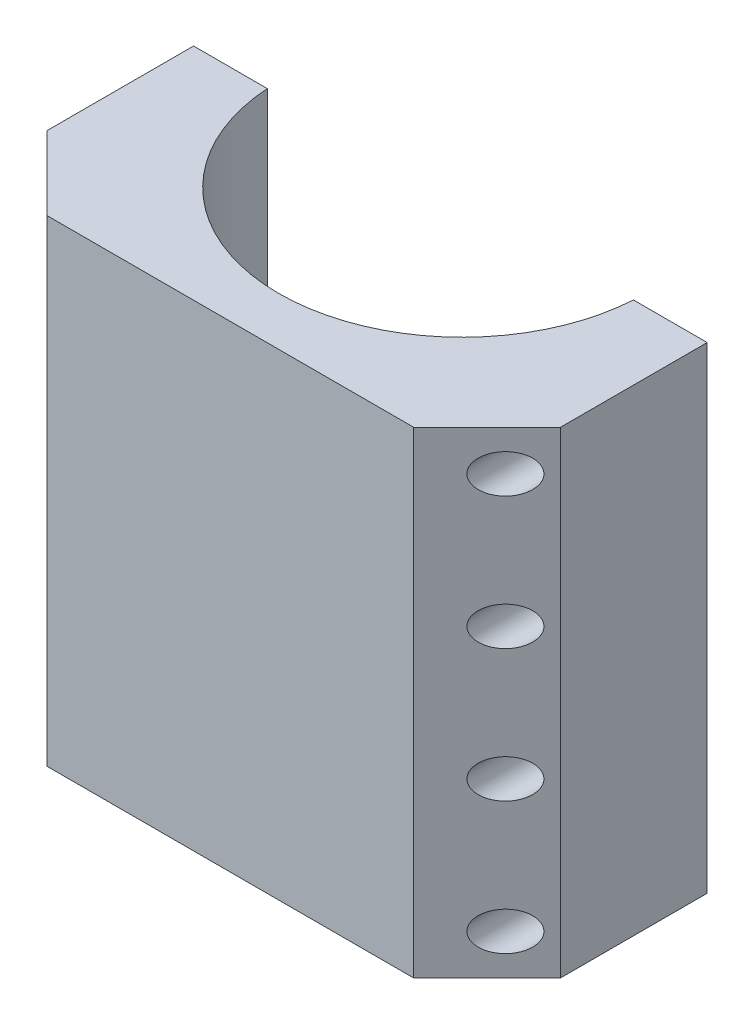
ISO-10303-21;
HEADER;
FILE_DESCRIPTION(('STEP AP214'),'2;1');
FILE_NAME('part.step','',(''),(''),'','','');
FILE_SCHEMA(('AUTOMOTIVE_DESIGN { 1 0 10303 214 1 1 1 1 }'));
ENDSEC;
DATA;
#1=APPLICATION_CONTEXT('core data for automotive mechanical design processes');
#2=APPLICATION_PROTOCOL_DEFINITION('international standard','automotive_design',2000,#1);
#3=PRODUCT_CONTEXT('',#1,'mechanical');
#4=PRODUCT('Part','Part','',(#3));
#5=PRODUCT_RELATED_PRODUCT_CATEGORY('part','',(#4));
#6=PRODUCT_DEFINITION_FORMATION('','',#4);
#7=PRODUCT_DEFINITION_CONTEXT('part definition',#1,'design');
#8=PRODUCT_DEFINITION('design','',#6,#7);
#9=PRODUCT_DEFINITION_SHAPE('','',#8);
#10=(LENGTH_UNIT() NAMED_UNIT(*) SI_UNIT(.MILLI.,.METRE.));
#11=(NAMED_UNIT(*) PLANE_ANGLE_UNIT() SI_UNIT($,.RADIAN.));
#12=(NAMED_UNIT(*) SI_UNIT($,.STERADIAN.) SOLID_ANGLE_UNIT());
#13=UNCERTAINTY_MEASURE_WITH_UNIT(LENGTH_MEASURE(1.E-05),#10,'distance_accuracy_value','');
#14=(GEOMETRIC_REPRESENTATION_CONTEXT(3) GLOBAL_UNCERTAINTY_ASSIGNED_CONTEXT((#13)) GLOBAL_UNIT_ASSIGNED_CONTEXT((#10,
#11,#12)) REPRESENTATION_CONTEXT('',''));
#15=CARTESIAN_POINT('',(0.,0.,0.));
#16=DIRECTION('',(0.,0.,1.));
#17=DIRECTION('',(1.,0.,0.));
#18=AXIS2_PLACEMENT_3D('',#15,#16,#17);
#19=CARTESIAN_POINT('',(7.50000000000002,-11.,0.));
#20=DIRECTION('',(0.,0.,1.));
#21=DIRECTION('',(1.,0.,0.));
#22=AXIS2_PLACEMENT_3D('',#19,#20,#21);
#23=CYLINDRICAL_SURFACE('',#22,3.);
#24=CARTESIAN_POINT('',(7.50000000000002,-11.,0.));
#25=DIRECTION('',(0.,0.,1.));
#26=DIRECTION('',(1.,0.,0.));
#27=AXIS2_PLACEMENT_3D('',#24,#25,#26);
#28=CIRCLE('',#27,3.);
#29=CARTESIAN_POINT('',(10.5,-11.,0.));
#30=VERTEX_POINT('',#29);
#31=EDGE_CURVE('E108',#30,#30,#28,.T.);
#32=ORIENTED_EDGE('',*,*,#31,.F.);
#33=EDGE_LOOP('',(#32));
#34=FACE_BOUND('',#33,.T.);
#35=CARTESIAN_POINT('',(7.50000000000002,-11.,25.));
#36=DIRECTION('',(0.,0.,1.));
#37=DIRECTION('',(1.,0.,0.));
#38=AXIS2_PLACEMENT_3D('',#35,#36,#37);
#39=CIRCLE('',#38,3.);
#40=CARTESIAN_POINT('',(10.5,-11.,25.));
#41=VERTEX_POINT('',#40);
#42=EDGE_CURVE('E180',#41,#41,#39,.F.);
#43=ORIENTED_EDGE('',*,*,#42,.F.);
#44=EDGE_LOOP('',(#43));
#45=FACE_BOUND('',#44,.T.);
#46=ADVANCED_FACE('F37',(#34,#45),#23,.F.);
#47=CARTESIAN_POINT('',(7.50000000000039,-47.,0.));
#48=DIRECTION('',(0.,0.,1.));
#49=DIRECTION('',(1.,0.,0.));
#50=AXIS2_PLACEMENT_3D('',#47,#48,#49);
#51=CYLINDRICAL_SURFACE('',#50,3.);
#52=CARTESIAN_POINT('',(7.50000000000039,-47.,0.));
#53=DIRECTION('',(0.,0.,1.));
#54=DIRECTION('',(1.,0.,0.));
#55=AXIS2_PLACEMENT_3D('',#52,#53,#54);
#56=CIRCLE('',#55,3.);
#57=CARTESIAN_POINT('',(10.5000000000004,-47.,0.));
#58=VERTEX_POINT('',#57);
#59=EDGE_CURVE('E214',#58,#58,#56,.T.);
#60=ORIENTED_EDGE('',*,*,#59,.F.);
#61=EDGE_LOOP('',(#60));
#62=FACE_BOUND('',#61,.T.);
#63=CARTESIAN_POINT('',(7.50000000000039,-47.,25.));
#64=DIRECTION('',(0.,0.,1.));
#65=DIRECTION('',(1.,0.,0.));
#66=AXIS2_PLACEMENT_3D('',#63,#64,#65);
#67=CIRCLE('',#66,3.);
#68=CARTESIAN_POINT('',(10.5000000000004,-47.,25.));
#69=VERTEX_POINT('',#68);
#70=EDGE_CURVE('E177',#69,#69,#67,.F.);
#71=ORIENTED_EDGE('',*,*,#70,.F.);
#72=EDGE_LOOP('',(#71));
#73=FACE_BOUND('',#72,.T.);
#74=ADVANCED_FACE('F265',(#62,#73),#51,.F.);
#75=CARTESIAN_POINT('',(7.50000000000076,-83.,0.));
#76=DIRECTION('',(0.,0.,1.));
#77=DIRECTION('',(1.,0.,0.));
#78=AXIS2_PLACEMENT_3D('',#75,#76,#77);
#79=CYLINDRICAL_SURFACE('',#78,3.);
#80=CARTESIAN_POINT('',(7.50000000000076,-83.,0.));
#81=DIRECTION('',(0.,0.,1.));
#82=DIRECTION('',(1.,0.,0.));
#83=AXIS2_PLACEMENT_3D('',#80,#81,#82);
#84=CIRCLE('',#83,3.);
#85=CARTESIAN_POINT('',(10.5000000000008,-83.,0.));
#86=VERTEX_POINT('',#85);
#87=EDGE_CURVE('E209',#86,#86,#84,.T.);
#88=ORIENTED_EDGE('',*,*,#87,.F.);
#89=EDGE_LOOP('',(#88));
#90=FACE_BOUND('',#89,.T.);
#91=CARTESIAN_POINT('',(7.50000000000076,-83.,25.));
#92=DIRECTION('',(0.,0.,1.));
#93=DIRECTION('',(1.,0.,0.));
#94=AXIS2_PLACEMENT_3D('',#91,#92,#93);
#95=CIRCLE('',#94,3.);
#96=CARTESIAN_POINT('',(10.5000000000008,-83.,25.));
#97=VERTEX_POINT('',#96);
#98=EDGE_CURVE('E174',#97,#97,#95,.F.);
#99=ORIENTED_EDGE('',*,*,#98,.F.);
#100=EDGE_LOOP('',(#99));
#101=FACE_BOUND('',#100,.T.);
#102=ADVANCED_FACE('F271',(#90,#101),#79,.F.);
#103=CARTESIAN_POINT('',(7.50000000000114,-119.,0.));
#104=DIRECTION('',(0.,0.,1.));
#105=DIRECTION('',(1.,0.,0.));
#106=AXIS2_PLACEMENT_3D('',#103,#104,#105);
#107=CYLINDRICAL_SURFACE('',#106,3.);
#108=CARTESIAN_POINT('',(7.50000000000114,-119.,0.));
#109=DIRECTION('',(0.,0.,1.));
#110=DIRECTION('',(1.,0.,0.));
#111=AXIS2_PLACEMENT_3D('',#108,#109,#110);
#112=CIRCLE('',#111,3.);
#113=CARTESIAN_POINT('',(10.5000000000011,-119.,0.));
#114=VERTEX_POINT('',#113);
#115=EDGE_CURVE('E205',#114,#114,#112,.T.);
#116=ORIENTED_EDGE('',*,*,#115,.F.);
#117=EDGE_LOOP('',(#116));
#118=FACE_BOUND('',#117,.T.);
#119=CARTESIAN_POINT('',(7.50000000000114,-119.,25.));
#120=DIRECTION('',(0.,0.,1.));
#121=DIRECTION('',(1.,0.,0.));
#122=AXIS2_PLACEMENT_3D('',#119,#120,#121);
#123=CIRCLE('',#122,3.);
#124=CARTESIAN_POINT('',(10.5000000000011,-119.,25.));
#125=VERTEX_POINT('',#124);
#126=EDGE_CURVE('E171',#125,#125,#123,.F.);
#127=ORIENTED_EDGE('',*,*,#126,.F.);
#128=EDGE_LOOP('',(#127));
#129=FACE_BOUND('',#128,.T.);
#130=ADVANCED_FACE('F278',(#118,#129),#107,.F.);
#131=CARTESIAN_POINT('',(132.5,-11.,0.));
#132=DIRECTION('',(0.,0.,1.));
#133=DIRECTION('',(1.,0.,0.));
#134=AXIS2_PLACEMENT_3D('',#131,#132,#133);
#135=CYLINDRICAL_SURFACE('',#134,3.00000000000002);
#136=CARTESIAN_POINT('',(132.5,-11.,0.));
#137=DIRECTION('',(0.,0.,1.));
#138=DIRECTION('',(1.,0.,0.));
#139=AXIS2_PLACEMENT_3D('',#136,#137,#138);
#140=CIRCLE('',#139,3.00000000000002);
#141=CARTESIAN_POINT('',(135.5,-11.,0.));
#142=VERTEX_POINT('',#141);
#143=EDGE_CURVE('E220',#142,#142,#140,.T.);
#144=ORIENTED_EDGE('',*,*,#143,.F.);
#145=EDGE_LOOP('',(#144));
#146=FACE_BOUND('',#145,.T.);
#147=CARTESIAN_POINT('',(132.5,-11.,25.));
#148=DIRECTION('',(0.,0.,1.));
#149=DIRECTION('',(1.,0.,0.));
#150=AXIS2_PLACEMENT_3D('',#147,#148,#149);
#151=CIRCLE('',#150,3.00000000000002);
#152=CARTESIAN_POINT('',(135.5,-11.,25.));
#153=VERTEX_POINT('',#152);
#154=EDGE_CURVE('E168',#153,#153,#151,.F.);
#155=ORIENTED_EDGE('',*,*,#154,.F.);
#156=EDGE_LOOP('',(#155));
#157=FACE_BOUND('',#156,.T.);
#158=ADVANCED_FACE('F366',(#146,#157),#135,.F.);
#159=CARTESIAN_POINT('',(132.5,-47.,0.));
#160=DIRECTION('',(0.,0.,1.));
#161=DIRECTION('',(1.,0.,0.));
#162=AXIS2_PLACEMENT_3D('',#159,#160,#161);
#163=CYLINDRICAL_SURFACE('',#162,3.00000000000002);
#164=CARTESIAN_POINT('',(132.5,-47.,0.));
#165=DIRECTION('',(0.,0.,1.));
#166=DIRECTION('',(1.,0.,0.));
#167=AXIS2_PLACEMENT_3D('',#164,#165,#166);
#168=CIRCLE('',#167,3.00000000000002);
#169=CARTESIAN_POINT('',(135.5,-47.,0.));
#170=VERTEX_POINT('',#169);
#171=EDGE_CURVE('E319',#170,#170,#168,.T.);
#172=ORIENTED_EDGE('',*,*,#171,.F.);
#173=EDGE_LOOP('',(#172));
#174=FACE_BOUND('',#173,.T.);
#175=CARTESIAN_POINT('',(132.5,-47.,25.));
#176=DIRECTION('',(0.,0.,1.));
#177=DIRECTION('',(1.,0.,0.));
#178=AXIS2_PLACEMENT_3D('',#175,#176,#177);
#179=CIRCLE('',#178,3.00000000000002);
#180=CARTESIAN_POINT('',(135.5,-47.,25.));
#181=VERTEX_POINT('',#180);
#182=EDGE_CURVE('E165',#181,#181,#179,.F.);
#183=ORIENTED_EDGE('',*,*,#182,.F.);
#184=EDGE_LOOP('',(#183));
#185=FACE_BOUND('',#184,.T.);
#186=ADVANCED_FACE('F369',(#174,#185),#163,.F.);
#187=CARTESIAN_POINT('',(132.500000000001,-83.,0.));
#188=DIRECTION('',(0.,0.,1.));
#189=DIRECTION('',(1.,0.,0.));
#190=AXIS2_PLACEMENT_3D('',#187,#188,#189);
#191=CYLINDRICAL_SURFACE('',#190,3.00000000000002);
#192=CARTESIAN_POINT('',(132.500000000001,-83.,0.));
#193=DIRECTION('',(0.,0.,1.));
#194=DIRECTION('',(1.,0.,0.));
#195=AXIS2_PLACEMENT_3D('',#192,#193,#194);
#196=CIRCLE('',#195,3.00000000000002);
#197=CARTESIAN_POINT('',(135.500000000001,-83.,0.));
#198=VERTEX_POINT('',#197);
#199=EDGE_CURVE('E322',#198,#198,#196,.T.);
#200=ORIENTED_EDGE('',*,*,#199,.F.);
#201=EDGE_LOOP('',(#200));
#202=FACE_BOUND('',#201,.T.);
#203=CARTESIAN_POINT('',(132.500000000001,-83.,25.));
#204=DIRECTION('',(0.,0.,1.));
#205=DIRECTION('',(1.,0.,0.));
#206=AXIS2_PLACEMENT_3D('',#203,#204,#205);
#207=CIRCLE('',#206,3.00000000000002);
#208=CARTESIAN_POINT('',(135.500000000001,-83.,25.));
#209=VERTEX_POINT('',#208);
#210=EDGE_CURVE('E161',#209,#209,#207,.F.);
#211=ORIENTED_EDGE('',*,*,#210,.F.);
#212=EDGE_LOOP('',(#211));
#213=FACE_BOUND('',#212,.T.);
#214=ADVANCED_FACE('F373',(#202,#213),#191,.F.);
#215=CARTESIAN_POINT('',(132.500000000001,-119.,0.));
#216=DIRECTION('',(0.,0.,1.));
#217=DIRECTION('',(1.,0.,0.));
#218=AXIS2_PLACEMENT_3D('',#215,#216,#217);
#219=CYLINDRICAL_SURFACE('',#218,3.00000000000002);
#220=CARTESIAN_POINT('',(132.500000000001,-119.,0.));
#221=DIRECTION('',(0.,0.,1.));
#222=DIRECTION('',(1.,0.,0.));
#223=AXIS2_PLACEMENT_3D('',#220,#221,#222);
#224=CIRCLE('',#223,3.00000000000002);
#225=CARTESIAN_POINT('',(135.500000000001,-119.,0.));
#226=VERTEX_POINT('',#225);
#227=EDGE_CURVE('E325',#226,#226,#224,.T.);
#228=ORIENTED_EDGE('',*,*,#227,.F.);
#229=EDGE_LOOP('',(#228));
#230=FACE_BOUND('',#229,.T.);
#231=CARTESIAN_POINT('',(132.500000000001,-119.,25.));
#232=DIRECTION('',(0.,0.,1.));
#233=DIRECTION('',(1.,0.,0.));
#234=AXIS2_PLACEMENT_3D('',#231,#232,#233);
#235=CIRCLE('',#234,3.00000000000002);
#236=CARTESIAN_POINT('',(135.500000000001,-119.,25.));
#237=VERTEX_POINT('',#236);
#238=EDGE_CURVE('E158',#237,#237,#235,.F.);
#239=ORIENTED_EDGE('',*,*,#238,.F.);
#240=EDGE_LOOP('',(#239));
#241=FACE_BOUND('',#240,.T.);
#242=ADVANCED_FACE('F262',(#230,#241),#219,.F.);
#243=CARTESIAN_POINT('',(0.,0.,0.));
#244=DIRECTION('',(0.,0.,1.));
#245=DIRECTION('',(1.,0.,0.));
#246=AXIS2_PLACEMENT_3D('',#243,#244,#245);
#247=PLANE('',#246);
#248=ORIENTED_EDGE('',*,*,#227,.T.);
#249=EDGE_LOOP('',(#248));
#250=FACE_BOUND('',#249,.T.);
#251=ORIENTED_EDGE('',*,*,#199,.T.);
#252=EDGE_LOOP('',(#251));
#253=FACE_BOUND('',#252,.T.);
#254=ORIENTED_EDGE('',*,*,#171,.T.);
#255=EDGE_LOOP('',(#254));
#256=FACE_BOUND('',#255,.T.);
#257=ORIENTED_EDGE('',*,*,#143,.T.);
#258=EDGE_LOOP('',(#257));
#259=FACE_BOUND('',#258,.T.);
#260=DIRECTION('',(1.,0.,0.));
#261=VECTOR('',#260,1.);
#262=CARTESIAN_POINT('',(0.,-130.,0.));
#263=LINE('',#262,#261);
#264=CARTESIAN_POINT('',(119.8974949271,-130.,0.));
#265=VERTEX_POINT('',#264);
#266=CARTESIAN_POINT('',(140.,-130.,0.));
#267=VERTEX_POINT('',#266);
#268=EDGE_CURVE('E116',#265,#267,#263,.T.);
#269=ORIENTED_EDGE('',*,*,#268,.F.);
#270=DIRECTION('',(0.,1.,0.));
#271=VECTOR('',#270,1.);
#272=CARTESIAN_POINT('',(119.8974949271,-130.,0.));
#273=LINE('',#272,#271);
#274=CARTESIAN_POINT('',(119.8974949271,0.,0.));
#275=VERTEX_POINT('',#274);
#276=EDGE_CURVE('E11',#265,#275,#273,.T.);
#277=ORIENTED_EDGE('',*,*,#276,.T.);
#278=DIRECTION('',(-1.,0.,0.));
#279=VECTOR('',#278,1.);
#280=CARTESIAN_POINT('',(0.,0.,0.));
#281=LINE('',#280,#279);
#282=CARTESIAN_POINT('',(140.,0.,0.));
#283=VERTEX_POINT('',#282);
#284=EDGE_CURVE('E115',#283,#275,#281,.T.);
#285=ORIENTED_EDGE('',*,*,#284,.F.);
#286=DIRECTION('',(0.,1.,0.));
#287=VECTOR('',#286,1.);
#288=CARTESIAN_POINT('',(140.,0.,0.));
#289=LINE('',#288,#287);
#290=EDGE_CURVE('E127',#267,#283,#289,.T.);
#291=ORIENTED_EDGE('',*,*,#290,.F.);
#292=EDGE_LOOP('',(#269,#277,#285,#291));
#293=FACE_BOUND('',#292,.T.);
#294=ADVANCED_FACE('F113',(#250,#253,#256,#259,#293),#247,.F.);
#295=CARTESIAN_POINT('',(0.,0.,60.));
#296=DIRECTION('',(1.,0.,0.));
#297=DIRECTION('',(0.,1.,0.));
#298=AXIS2_PLACEMENT_3D('',#295,#296,#297);
#299=PLANE('',#298);
#300=DIRECTION('',(0.,0.,-1.));
#301=VECTOR('',#300,1.);
#302=CARTESIAN_POINT('',(0.,-130.,60.));
#303=LINE('',#302,#301);
#304=CARTESIAN_POINT('',(0.,-130.,39.9999999999999));
#305=VERTEX_POINT('',#304);
#306=CARTESIAN_POINT('',(0.,-130.,0.));
#307=VERTEX_POINT('',#306);
#308=EDGE_CURVE('E138',#305,#307,#303,.T.);
#309=ORIENTED_EDGE('',*,*,#308,.F.);
#310=DIRECTION('',(0.,1.,0.));
#311=VECTOR('',#310,1.);
#312=CARTESIAN_POINT('',(0.,0.,39.9999999999999));
#313=LINE('',#312,#311);
#314=CARTESIAN_POINT('',(0.,0.,39.9999999999999));
#315=VERTEX_POINT('',#314);
#316=EDGE_CURVE('E155',#305,#315,#313,.T.);
#317=ORIENTED_EDGE('',*,*,#316,.T.);
#318=DIRECTION('',(0.,0.,-1.));
#319=VECTOR('',#318,1.);
#320=CARTESIAN_POINT('',(0.,0.,60.));
#321=LINE('',#320,#319);
#322=CARTESIAN_POINT('',(0.,0.,0.));
#323=VERTEX_POINT('',#322);
#324=EDGE_CURVE('E131',#315,#323,#321,.T.);
#325=ORIENTED_EDGE('',*,*,#324,.T.);
#326=DIRECTION('',(0.,-1.,0.));
#327=VECTOR('',#326,1.);
#328=CARTESIAN_POINT('',(0.,0.,0.));
#329=LINE('',#328,#327);
#330=EDGE_CURVE('E221',#323,#307,#329,.T.);
#331=ORIENTED_EDGE('',*,*,#330,.T.);
#332=EDGE_LOOP('',(#309,#317,#325,#331));
#333=FACE_BOUND('',#332,.T.);
#334=ADVANCED_FACE('F247',(#333),#299,.F.);
#335=CARTESIAN_POINT('',(0.,-130.,60.));
#336=DIRECTION('',(0.,1.,0.));
#337=DIRECTION('',(0.,0.,1.));
#338=AXIS2_PLACEMENT_3D('',#335,#336,#337);
#339=PLANE('',#338);
#340=CARTESIAN_POINT('',(20.1025050728997,-130.,0.));
#341=VERTEX_POINT('',#340);
#342=EDGE_CURVE('E226',#307,#341,#263,.T.);
#343=ORIENTED_EDGE('',*,*,#342,.T.);
#344=CARTESIAN_POINT('',(70.,-130.,-3.20000000000001));
#345=DIRECTION('',(0.,1.,0.));
#346=DIRECTION('',(0.,0.,1.));
#347=AXIS2_PLACEMENT_3D('',#344,#345,#346);
#348=CIRCLE('',#347,50.);
#349=EDGE_CURVE('E55',#341,#265,#348,.T.);
#350=ORIENTED_EDGE('',*,*,#349,.T.);
#351=ORIENTED_EDGE('',*,*,#268,.T.);
#352=DIRECTION('',(0.,0.,-1.));
#353=VECTOR('',#352,1.);
#354=CARTESIAN_POINT('',(140.,-130.,60.));
#355=LINE('',#354,#353);
#356=CARTESIAN_POINT('',(140.,-130.,39.9999999999999));
#357=VERTEX_POINT('',#356);
#358=EDGE_CURVE('E135',#357,#267,#355,.T.);
#359=ORIENTED_EDGE('',*,*,#358,.F.);
#360=DIRECTION('',(-0.707106781186546,0.,0.70710678118655));
#361=VECTOR('',#360,1.);
#362=CARTESIAN_POINT('',(120.,-130.,60.));
#363=LINE('',#362,#361);
#364=CARTESIAN_POINT('',(120.,-130.,60.));
#365=VERTEX_POINT('',#364);
#366=EDGE_CURVE('E153',#357,#365,#363,.T.);
#367=ORIENTED_EDGE('',*,*,#366,.T.);
#368=DIRECTION('',(1.,0.,0.));
#369=VECTOR('',#368,1.);
#370=CARTESIAN_POINT('',(0.,-130.,60.));
#371=LINE('',#370,#369);
#372=CARTESIAN_POINT('',(20.,-130.,60.));
#373=VERTEX_POINT('',#372);
#374=EDGE_CURVE('E121',#373,#365,#371,.T.);
#375=ORIENTED_EDGE('',*,*,#374,.F.);
#376=DIRECTION('',(-0.707106781186546,0.,-0.707106781186549));
#377=VECTOR('',#376,1.);
#378=CARTESIAN_POINT('',(20.,-130.,60.));
#379=LINE('',#378,#377);
#380=EDGE_CURVE('E63',#373,#305,#379,.T.);
#381=ORIENTED_EDGE('',*,*,#380,.T.);
#382=ORIENTED_EDGE('',*,*,#308,.T.);
#383=EDGE_LOOP('',(#343,#350,#351,#359,#367,#375,#381,#382));
#384=FACE_BOUND('',#383,.T.);
#385=ADVANCED_FACE('F230',(#384),#339,.F.);
#386=CARTESIAN_POINT('',(140.,0.,60.));
#387=DIRECTION('',(-1.,0.,0.));
#388=DIRECTION('',(0.,0.,1.));
#389=AXIS2_PLACEMENT_3D('',#386,#387,#388);
#390=PLANE('',#389);
#391=DIRECTION('',(0.,0.,-1.));
#392=VECTOR('',#391,1.);
#393=CARTESIAN_POINT('',(140.,0.,60.));
#394=LINE('',#393,#392);
#395=CARTESIAN_POINT('',(140.,0.,39.9999999999999));
#396=VERTEX_POINT('',#395);
#397=EDGE_CURVE('E119',#396,#283,#394,.T.);
#398=ORIENTED_EDGE('',*,*,#397,.F.);
#399=DIRECTION('',(0.,-1.,0.));
#400=VECTOR('',#399,1.);
#401=CARTESIAN_POINT('',(140.,-130.,39.9999999999999));
#402=LINE('',#401,#400);
#403=EDGE_CURVE('E150',#396,#357,#402,.T.);
#404=ORIENTED_EDGE('',*,*,#403,.T.);
#405=ORIENTED_EDGE('',*,*,#358,.T.);
#406=ORIENTED_EDGE('',*,*,#290,.T.);
#407=EDGE_LOOP('',(#398,#404,#405,#406));
#408=FACE_BOUND('',#407,.T.);
#409=ADVANCED_FACE('F233',(#408),#390,.F.);
#410=CARTESIAN_POINT('',(0.,0.,60.));
#411=DIRECTION('',(0.,-1.,0.));
#412=DIRECTION('',(0.,0.,-1.));
#413=AXIS2_PLACEMENT_3D('',#410,#411,#412);
#414=PLANE('',#413);
#415=ORIENTED_EDGE('',*,*,#284,.T.);
#416=CARTESIAN_POINT('',(70.,0.,-3.20000000000001));
#417=DIRECTION('',(0.,1.,0.));
#418=DIRECTION('',(0.,0.,1.));
#419=AXIS2_PLACEMENT_3D('',#416,#417,#418);
#420=CIRCLE('',#419,50.);
#421=CARTESIAN_POINT('',(20.1025050728997,0.,0.));
#422=VERTEX_POINT('',#421);
#423=EDGE_CURVE('E103',#422,#275,#420,.T.);
#424=ORIENTED_EDGE('',*,*,#423,.F.);
#425=EDGE_CURVE('E122',#422,#323,#281,.T.);
#426=ORIENTED_EDGE('',*,*,#425,.T.);
#427=ORIENTED_EDGE('',*,*,#324,.F.);
#428=DIRECTION('',(0.707106781186546,0.,0.707106781186549));
#429=VECTOR('',#428,1.);
#430=CARTESIAN_POINT('',(20.,0.,60.));
#431=LINE('',#430,#429);
#432=CARTESIAN_POINT('',(20.,0.,60.));
#433=VERTEX_POINT('',#432);
#434=EDGE_CURVE('E146',#315,#433,#431,.T.);
#435=ORIENTED_EDGE('',*,*,#434,.T.);
#436=DIRECTION('',(-1.,0.,0.));
#437=VECTOR('',#436,1.);
#438=CARTESIAN_POINT('',(0.,0.,60.));
#439=LINE('',#438,#437);
#440=CARTESIAN_POINT('',(120.,0.,60.));
#441=VERTEX_POINT('',#440);
#442=EDGE_CURVE('E125',#441,#433,#439,.T.);
#443=ORIENTED_EDGE('',*,*,#442,.F.);
#444=DIRECTION('',(0.707106781186546,0.,-0.70710678118655));
#445=VECTOR('',#444,1.);
#446=CARTESIAN_POINT('',(120.,0.,60.));
#447=LINE('',#446,#445);
#448=EDGE_CURVE('E148',#441,#396,#447,.T.);
#449=ORIENTED_EDGE('',*,*,#448,.T.);
#450=ORIENTED_EDGE('',*,*,#397,.T.);
#451=EDGE_LOOP('',(#415,#424,#426,#427,#435,#443,#449,#450));
#452=FACE_BOUND('',#451,.T.);
#453=ADVANCED_FACE('F117',(#452),#414,.F.);
#454=CARTESIAN_POINT('',(0.,0.,60.));
#455=DIRECTION('',(0.,0.,1.));
#456=DIRECTION('',(1.,0.,0.));
#457=AXIS2_PLACEMENT_3D('',#454,#455,#456);
#458=PLANE('',#457);
#459=ORIENTED_EDGE('',*,*,#374,.T.);
#460=DIRECTION('',(0.,1.,0.));
#461=VECTOR('',#460,1.);
#462=CARTESIAN_POINT('',(120.,0.,60.));
#463=LINE('',#462,#461);
#464=EDGE_CURVE('E143',#365,#441,#463,.T.);
#465=ORIENTED_EDGE('',*,*,#464,.T.);
#466=ORIENTED_EDGE('',*,*,#442,.T.);
#467=DIRECTION('',(0.,-1.,0.));
#468=VECTOR('',#467,1.);
#469=CARTESIAN_POINT('',(20.,-130.,60.));
#470=LINE('',#469,#468);
#471=EDGE_CURVE('E140',#433,#373,#470,.T.);
#472=ORIENTED_EDGE('',*,*,#471,.T.);
#473=EDGE_LOOP('',(#459,#465,#466,#472));
#474=FACE_BOUND('',#473,.T.);
#475=ADVANCED_FACE('F239',(#474),#458,.T.);
#476=ORIENTED_EDGE('',*,*,#115,.T.);
#477=EDGE_LOOP('',(#476));
#478=FACE_BOUND('',#477,.T.);
#479=ORIENTED_EDGE('',*,*,#87,.T.);
#480=EDGE_LOOP('',(#479));
#481=FACE_BOUND('',#480,.T.);
#482=ORIENTED_EDGE('',*,*,#59,.T.);
#483=EDGE_LOOP('',(#482));
#484=FACE_BOUND('',#483,.T.);
#485=ORIENTED_EDGE('',*,*,#31,.T.);
#486=EDGE_LOOP('',(#485));
#487=FACE_BOUND('',#486,.T.);
#488=ORIENTED_EDGE('',*,*,#425,.F.);
#489=DIRECTION('',(0.,1.,0.));
#490=VECTOR('',#489,1.);
#491=CARTESIAN_POINT('',(20.1025050728997,-130.,0.));
#492=LINE('',#491,#490);
#493=EDGE_CURVE('E47',#422,#341,#492,.F.);
#494=ORIENTED_EDGE('',*,*,#493,.T.);
#495=ORIENTED_EDGE('',*,*,#342,.F.);
#496=ORIENTED_EDGE('',*,*,#330,.F.);
#497=EDGE_LOOP('',(#488,#494,#495,#496));
#498=FACE_BOUND('',#497,.T.);
#499=ADVANCED_FACE('F250',(#478,#481,#484,#487,#498),#247,.F.);
#500=CARTESIAN_POINT('',(120.,0.,60.));
#501=DIRECTION('',(0.70710678118655,0.,0.707106781186546));
#502=DIRECTION('',(0.,-1.,0.));
#503=AXIS2_PLACEMENT_3D('',#500,#501,#502);
#504=PLANE('',#503);
#505=CARTESIAN_POINT('',(132.500000000001,-119.,47.4999999999988));
#506=DIRECTION('',(0.70710678118655,0.,0.707106781186546));
#507=DIRECTION('',(-0.707106781186546,0.,0.70710678118655));
#508=AXIS2_PLACEMENT_3D('',#505,#506,#507);
#509=ELLIPSE('',#508,7.42462120245877,5.25);
#510=CARTESIAN_POINT('',(127.250000000001,-119.,52.7499999999988));
#511=VERTEX_POINT('',#510);
#512=EDGE_CURVE('E42',#511,#511,#509,.T.);
#513=ORIENTED_EDGE('',*,*,#512,.F.);
#514=EDGE_LOOP('',(#513));
#515=FACE_BOUND('',#514,.T.);
#516=CARTESIAN_POINT('',(132.500000000001,-83.,47.4999999999992));
#517=DIRECTION('',(0.70710678118655,0.,0.707106781186546));
#518=DIRECTION('',(-0.707106781186546,0.,0.70710678118655));
#519=AXIS2_PLACEMENT_3D('',#516,#517,#518);
#520=ELLIPSE('',#519,7.42462120245877,5.25);
#521=CARTESIAN_POINT('',(127.250000000001,-83.,52.7499999999992));
#522=VERTEX_POINT('',#521);
#523=EDGE_CURVE('E200',#522,#522,#520,.T.);
#524=ORIENTED_EDGE('',*,*,#523,.F.);
#525=EDGE_LOOP('',(#524));
#526=FACE_BOUND('',#525,.T.);
#527=CARTESIAN_POINT('',(132.5,-47.,47.4999999999996));
#528=DIRECTION('',(0.70710678118655,0.,0.707106781186546));
#529=DIRECTION('',(-0.707106781186546,0.,0.70710678118655));
#530=AXIS2_PLACEMENT_3D('',#527,#528,#529);
#531=ELLIPSE('',#530,7.42462120245877,5.25);
#532=CARTESIAN_POINT('',(127.25,-47.,52.7499999999996));
#533=VERTEX_POINT('',#532);
#534=EDGE_CURVE('E198',#533,#533,#531,.T.);
#535=ORIENTED_EDGE('',*,*,#534,.F.);
#536=EDGE_LOOP('',(#535));
#537=FACE_BOUND('',#536,.T.);
#538=CARTESIAN_POINT('',(132.5,-11.,47.4999999999999));
#539=DIRECTION('',(0.70710678118655,0.,0.707106781186546));
#540=DIRECTION('',(-0.707106781186546,0.,0.70710678118655));
#541=AXIS2_PLACEMENT_3D('',#538,#539,#540);
#542=ELLIPSE('',#541,7.42462120245877,5.25);
#543=CARTESIAN_POINT('',(127.25,-11.,52.75));
#544=VERTEX_POINT('',#543);
#545=EDGE_CURVE('E195',#544,#544,#542,.T.);
#546=ORIENTED_EDGE('',*,*,#545,.F.);
#547=EDGE_LOOP('',(#546));
#548=FACE_BOUND('',#547,.T.);
#549=ORIENTED_EDGE('',*,*,#366,.F.);
#550=ORIENTED_EDGE('',*,*,#403,.F.);
#551=ORIENTED_EDGE('',*,*,#448,.F.);
#552=ORIENTED_EDGE('',*,*,#464,.F.);
#553=EDGE_LOOP('',(#549,#550,#551,#552));
#554=FACE_BOUND('',#553,.T.);
#555=ADVANCED_FACE('F236',(#515,#526,#537,#548,#554),#504,.T.);
#556=CARTESIAN_POINT('',(20.,0.,60.));
#557=DIRECTION('',(-0.707106781186549,0.,0.707106781186546));
#558=DIRECTION('',(0.,1.,0.));
#559=AXIS2_PLACEMENT_3D('',#556,#557,#558);
#560=PLANE('',#559);
#561=CARTESIAN_POINT('',(7.50000000000114,-119.,47.5000000000011));
#562=DIRECTION('',(-0.707106781186549,0.,0.707106781186546));
#563=DIRECTION('',(0.707106781186546,0.,0.707106781186549));
#564=AXIS2_PLACEMENT_3D('',#561,#562,#563);
#565=ELLIPSE('',#564,7.42462120245876,5.25);
#566=CARTESIAN_POINT('',(12.7500000000011,-119.,52.7500000000011));
#567=VERTEX_POINT('',#566);
#568=EDGE_CURVE('E192',#567,#567,#565,.T.);
#569=ORIENTED_EDGE('',*,*,#568,.F.);
#570=EDGE_LOOP('',(#569));
#571=FACE_BOUND('',#570,.T.);
#572=CARTESIAN_POINT('',(7.50000000000076,-83.,47.5000000000007));
#573=DIRECTION('',(-0.707106781186549,0.,0.707106781186546));
#574=DIRECTION('',(0.707106781186546,0.,0.707106781186549));
#575=AXIS2_PLACEMENT_3D('',#572,#573,#574);
#576=ELLIPSE('',#575,7.42462120245876,5.25);
#577=CARTESIAN_POINT('',(12.7500000000008,-83.,52.7500000000007));
#578=VERTEX_POINT('',#577);
#579=EDGE_CURVE('E189',#578,#578,#576,.T.);
#580=ORIENTED_EDGE('',*,*,#579,.F.);
#581=EDGE_LOOP('',(#580));
#582=FACE_BOUND('',#581,.T.);
#583=CARTESIAN_POINT('',(7.50000000000039,-47.,47.5000000000003));
#584=DIRECTION('',(-0.707106781186549,0.,0.707106781186546));
#585=DIRECTION('',(0.707106781186546,0.,0.707106781186549));
#586=AXIS2_PLACEMENT_3D('',#583,#584,#585);
#587=ELLIPSE('',#586,7.42462120245876,5.25);
#588=CARTESIAN_POINT('',(12.7500000000004,-47.,52.7500000000003));
#589=VERTEX_POINT('',#588);
#590=EDGE_CURVE('E186',#589,#589,#587,.T.);
#591=ORIENTED_EDGE('',*,*,#590,.F.);
#592=EDGE_LOOP('',(#591));
#593=FACE_BOUND('',#592,.T.);
#594=CARTESIAN_POINT('',(7.50000000000002,-11.,47.4999999999999));
#595=DIRECTION('',(-0.707106781186549,0.,0.707106781186546));
#596=DIRECTION('',(0.707106781186546,0.,0.707106781186549));
#597=AXIS2_PLACEMENT_3D('',#594,#595,#596);
#598=ELLIPSE('',#597,7.42462120245876,5.25);
#599=CARTESIAN_POINT('',(12.75,-11.,52.75));
#600=VERTEX_POINT('',#599);
#601=EDGE_CURVE('E183',#600,#600,#598,.T.);
#602=ORIENTED_EDGE('',*,*,#601,.F.);
#603=EDGE_LOOP('',(#602));
#604=FACE_BOUND('',#603,.T.);
#605=ORIENTED_EDGE('',*,*,#434,.F.);
#606=ORIENTED_EDGE('',*,*,#316,.F.);
#607=ORIENTED_EDGE('',*,*,#380,.F.);
#608=ORIENTED_EDGE('',*,*,#471,.F.);
#609=EDGE_LOOP('',(#605,#606,#607,#608));
#610=FACE_BOUND('',#609,.T.);
#611=ADVANCED_FACE('F40',(#571,#582,#593,#604,#610),#560,.T.);
#612=CARTESIAN_POINT('',(70.,-130.,-3.20000000000001));
#613=DIRECTION('',(0.,1.,0.));
#614=DIRECTION('',(0.,0.,1.));
#615=AXIS2_PLACEMENT_3D('',#612,#613,#614);
#616=CYLINDRICAL_SURFACE('',#615,50.);
#617=ORIENTED_EDGE('',*,*,#349,.F.);
#618=ORIENTED_EDGE('',*,*,#493,.F.);
#619=ORIENTED_EDGE('',*,*,#423,.T.);
#620=ORIENTED_EDGE('',*,*,#276,.F.);
#621=EDGE_LOOP('',(#617,#618,#619,#620));
#622=FACE_BOUND('',#621,.T.);
#623=ADVANCED_FACE('F104',(#622),#616,.F.);
#624=CARTESIAN_POINT('',(132.500000000001,-119.,25.));
#625=DIRECTION('',(0.,0.,1.));
#626=DIRECTION('',(1.,0.,0.));
#627=AXIS2_PLACEMENT_3D('',#624,#625,#626);
#628=PLANE('',#627);
#629=CARTESIAN_POINT('',(132.500000000001,-119.,25.));
#630=DIRECTION('',(0.,0.,1.));
#631=DIRECTION('',(1.,0.,0.));
#632=AXIS2_PLACEMENT_3D('',#629,#630,#631);
#633=CIRCLE('',#632,5.25);
#634=CARTESIAN_POINT('',(137.750000000001,-119.,25.));
#635=VERTEX_POINT('',#634);
#636=EDGE_CURVE('E621',#635,#635,#633,.T.);
#637=ORIENTED_EDGE('',*,*,#636,.T.);
#638=EDGE_LOOP('',(#637));
#639=FACE_BOUND('',#638,.T.);
#640=ORIENTED_EDGE('',*,*,#238,.T.);
#641=EDGE_LOOP('',(#640));
#642=FACE_BOUND('',#641,.T.);
#643=ADVANCED_FACE('F281',(#639,#642),#628,.T.);
#644=CARTESIAN_POINT('',(132.500000000001,-119.,25.));
#645=DIRECTION('',(0.,0.,1.));
#646=DIRECTION('',(1.,0.,0.));
#647=AXIS2_PLACEMENT_3D('',#644,#645,#646);
#648=CYLINDRICAL_SURFACE('',#647,5.25);
#649=ORIENTED_EDGE('',*,*,#512,.T.);
#650=EDGE_LOOP('',(#649));
#651=FACE_BOUND('',#650,.T.);
#652=ORIENTED_EDGE('',*,*,#636,.F.);
#653=EDGE_LOOP('',(#652));
#654=FACE_BOUND('',#653,.T.);
#655=ADVANCED_FACE('F286',(#651,#654),#648,.F.);
#656=CARTESIAN_POINT('',(132.500000000001,-83.,25.));
#657=DIRECTION('',(0.,0.,1.));
#658=DIRECTION('',(1.,0.,0.));
#659=AXIS2_PLACEMENT_3D('',#656,#657,#658);
#660=PLANE('',#659);
#661=CARTESIAN_POINT('',(132.500000000001,-83.,25.));
#662=DIRECTION('',(0.,0.,1.));
#663=DIRECTION('',(1.,0.,0.));
#664=AXIS2_PLACEMENT_3D('',#661,#662,#663);
#665=CIRCLE('',#664,5.25);
#666=CARTESIAN_POINT('',(137.750000000001,-83.,25.));
#667=VERTEX_POINT('',#666);
#668=EDGE_CURVE('E618',#667,#667,#665,.T.);
#669=ORIENTED_EDGE('',*,*,#668,.T.);
#670=EDGE_LOOP('',(#669));
#671=FACE_BOUND('',#670,.T.);
#672=ORIENTED_EDGE('',*,*,#210,.T.);
#673=EDGE_LOOP('',(#672));
#674=FACE_BOUND('',#673,.T.);
#675=ADVANCED_FACE('F501',(#671,#674),#660,.T.);
#676=CARTESIAN_POINT('',(132.500000000001,-83.,25.));
#677=DIRECTION('',(0.,0.,1.));
#678=DIRECTION('',(1.,0.,0.));
#679=AXIS2_PLACEMENT_3D('',#676,#677,#678);
#680=CYLINDRICAL_SURFACE('',#679,5.25);
#681=ORIENTED_EDGE('',*,*,#523,.T.);
#682=EDGE_LOOP('',(#681));
#683=FACE_BOUND('',#682,.T.);
#684=ORIENTED_EDGE('',*,*,#668,.F.);
#685=EDGE_LOOP('',(#684));
#686=FACE_BOUND('',#685,.T.);
#687=ADVANCED_FACE('F508',(#683,#686),#680,.F.);
#688=CARTESIAN_POINT('',(132.5,-47.,25.));
#689=DIRECTION('',(0.,0.,1.));
#690=DIRECTION('',(1.,0.,0.));
#691=AXIS2_PLACEMENT_3D('',#688,#689,#690);
#692=PLANE('',#691);
#693=CARTESIAN_POINT('',(132.5,-47.,25.));
#694=DIRECTION('',(0.,0.,1.));
#695=DIRECTION('',(1.,0.,0.));
#696=AXIS2_PLACEMENT_3D('',#693,#694,#695);
#697=CIRCLE('',#696,5.25);
#698=CARTESIAN_POINT('',(137.75,-47.,25.));
#699=VERTEX_POINT('',#698);
#700=EDGE_CURVE('E311',#699,#699,#697,.T.);
#701=ORIENTED_EDGE('',*,*,#700,.T.);
#702=EDGE_LOOP('',(#701));
#703=FACE_BOUND('',#702,.T.);
#704=ORIENTED_EDGE('',*,*,#182,.T.);
#705=EDGE_LOOP('',(#704));
#706=FACE_BOUND('',#705,.T.);
#707=ADVANCED_FACE('F517',(#703,#706),#692,.T.);
#708=CARTESIAN_POINT('',(132.5,-47.,25.));
#709=DIRECTION('',(0.,0.,1.));
#710=DIRECTION('',(1.,0.,0.));
#711=AXIS2_PLACEMENT_3D('',#708,#709,#710);
#712=CYLINDRICAL_SURFACE('',#711,5.25);
#713=ORIENTED_EDGE('',*,*,#534,.T.);
#714=EDGE_LOOP('',(#713));
#715=FACE_BOUND('',#714,.T.);
#716=ORIENTED_EDGE('',*,*,#700,.F.);
#717=EDGE_LOOP('',(#716));
#718=FACE_BOUND('',#717,.T.);
#719=ADVANCED_FACE('F525',(#715,#718),#712,.F.);
#720=CARTESIAN_POINT('',(132.5,-11.,25.));
#721=DIRECTION('',(0.,0.,1.));
#722=DIRECTION('',(1.,0.,0.));
#723=AXIS2_PLACEMENT_3D('',#720,#721,#722);
#724=PLANE('',#723);
#725=CARTESIAN_POINT('',(132.5,-11.,25.));
#726=DIRECTION('',(0.,0.,1.));
#727=DIRECTION('',(1.,0.,0.));
#728=AXIS2_PLACEMENT_3D('',#725,#726,#727);
#729=CIRCLE('',#728,5.25);
#730=CARTESIAN_POINT('',(137.75,-11.,25.));
#731=VERTEX_POINT('',#730);
#732=EDGE_CURVE('E308',#731,#731,#729,.T.);
#733=ORIENTED_EDGE('',*,*,#732,.T.);
#734=EDGE_LOOP('',(#733));
#735=FACE_BOUND('',#734,.T.);
#736=ORIENTED_EDGE('',*,*,#154,.T.);
#737=EDGE_LOOP('',(#736));
#738=FACE_BOUND('',#737,.T.);
#739=ADVANCED_FACE('F534',(#735,#738),#724,.T.);
#740=CARTESIAN_POINT('',(132.5,-11.,25.));
#741=DIRECTION('',(0.,0.,1.));
#742=DIRECTION('',(1.,0.,0.));
#743=AXIS2_PLACEMENT_3D('',#740,#741,#742);
#744=CYLINDRICAL_SURFACE('',#743,5.25);
#745=ORIENTED_EDGE('',*,*,#545,.T.);
#746=EDGE_LOOP('',(#745));
#747=FACE_BOUND('',#746,.T.);
#748=ORIENTED_EDGE('',*,*,#732,.F.);
#749=EDGE_LOOP('',(#748));
#750=FACE_BOUND('',#749,.T.);
#751=ADVANCED_FACE('F359',(#747,#750),#744,.F.);
#752=CARTESIAN_POINT('',(7.50000000000114,-119.,25.));
#753=DIRECTION('',(0.,0.,1.));
#754=DIRECTION('',(1.,0.,0.));
#755=AXIS2_PLACEMENT_3D('',#752,#753,#754);
#756=PLANE('',#755);
#757=CARTESIAN_POINT('',(7.50000000000114,-119.,25.));
#758=DIRECTION('',(0.,0.,1.));
#759=DIRECTION('',(1.,0.,0.));
#760=AXIS2_PLACEMENT_3D('',#757,#758,#759);
#761=CIRCLE('',#760,5.25);
#762=CARTESIAN_POINT('',(12.7500000000011,-119.,25.));
#763=VERTEX_POINT('',#762);
#764=EDGE_CURVE('E315',#763,#763,#761,.T.);
#765=ORIENTED_EDGE('',*,*,#764,.T.);
#766=EDGE_LOOP('',(#765));
#767=FACE_BOUND('',#766,.T.);
#768=ORIENTED_EDGE('',*,*,#126,.T.);
#769=EDGE_LOOP('',(#768));
#770=FACE_BOUND('',#769,.T.);
#771=ADVANCED_FACE('F356',(#767,#770),#756,.T.);
#772=CARTESIAN_POINT('',(7.50000000000114,-119.,25.));
#773=DIRECTION('',(0.,0.,1.));
#774=DIRECTION('',(1.,0.,0.));
#775=AXIS2_PLACEMENT_3D('',#772,#773,#774);
#776=CYLINDRICAL_SURFACE('',#775,5.25);
#777=ORIENTED_EDGE('',*,*,#568,.T.);
#778=EDGE_LOOP('',(#777));
#779=FACE_BOUND('',#778,.T.);
#780=ORIENTED_EDGE('',*,*,#764,.F.);
#781=EDGE_LOOP('',(#780));
#782=FACE_BOUND('',#781,.T.);
#783=ADVANCED_FACE('F353',(#779,#782),#776,.F.);
#784=CARTESIAN_POINT('',(7.50000000000076,-83.,25.));
#785=DIRECTION('',(0.,0.,1.));
#786=DIRECTION('',(1.,0.,0.));
#787=AXIS2_PLACEMENT_3D('',#784,#785,#786);
#788=PLANE('',#787);
#789=CARTESIAN_POINT('',(7.50000000000076,-83.,25.));
#790=DIRECTION('',(0.,0.,1.));
#791=DIRECTION('',(1.,0.,0.));
#792=AXIS2_PLACEMENT_3D('',#789,#790,#791);
#793=CIRCLE('',#792,5.25);
#794=CARTESIAN_POINT('',(12.7500000000008,-83.,25.));
#795=VERTEX_POINT('',#794);
#796=EDGE_CURVE('E627',#795,#795,#793,.T.);
#797=ORIENTED_EDGE('',*,*,#796,.T.);
#798=EDGE_LOOP('',(#797));
#799=FACE_BOUND('',#798,.T.);
#800=ORIENTED_EDGE('',*,*,#98,.T.);
#801=EDGE_LOOP('',(#800));
#802=FACE_BOUND('',#801,.T.);
#803=ADVANCED_FACE('F346',(#799,#802),#788,.T.);
#804=CARTESIAN_POINT('',(7.50000000000076,-83.,25.));
#805=DIRECTION('',(0.,0.,1.));
#806=DIRECTION('',(1.,0.,0.));
#807=AXIS2_PLACEMENT_3D('',#804,#805,#806);
#808=CYLINDRICAL_SURFACE('',#807,5.25);
#809=ORIENTED_EDGE('',*,*,#579,.T.);
#810=EDGE_LOOP('',(#809));
#811=FACE_BOUND('',#810,.T.);
#812=ORIENTED_EDGE('',*,*,#796,.F.);
#813=EDGE_LOOP('',(#812));
#814=FACE_BOUND('',#813,.T.);
#815=ADVANCED_FACE('F337',(#811,#814),#808,.F.);
#816=CARTESIAN_POINT('',(7.50000000000039,-47.,25.));
#817=DIRECTION('',(0.,0.,1.));
#818=DIRECTION('',(1.,0.,0.));
#819=AXIS2_PLACEMENT_3D('',#816,#817,#818);
#820=PLANE('',#819);
#821=CARTESIAN_POINT('',(7.50000000000039,-47.,25.));
#822=DIRECTION('',(0.,0.,1.));
#823=DIRECTION('',(1.,0.,0.));
#824=AXIS2_PLACEMENT_3D('',#821,#822,#823);
#825=CIRCLE('',#824,5.25);
#826=CARTESIAN_POINT('',(12.7500000000004,-47.,25.));
#827=VERTEX_POINT('',#826);
#828=EDGE_CURVE('E626',#827,#827,#825,.T.);
#829=ORIENTED_EDGE('',*,*,#828,.T.);
#830=EDGE_LOOP('',(#829));
#831=FACE_BOUND('',#830,.T.);
#832=ORIENTED_EDGE('',*,*,#70,.T.);
#833=EDGE_LOOP('',(#832));
#834=FACE_BOUND('',#833,.T.);
#835=ADVANCED_FACE('F334',(#831,#834),#820,.T.);
#836=CARTESIAN_POINT('',(7.50000000000039,-47.,25.));
#837=DIRECTION('',(0.,0.,1.));
#838=DIRECTION('',(1.,0.,0.));
#839=AXIS2_PLACEMENT_3D('',#836,#837,#838);
#840=CYLINDRICAL_SURFACE('',#839,5.25);
#841=ORIENTED_EDGE('',*,*,#590,.T.);
#842=EDGE_LOOP('',(#841));
#843=FACE_BOUND('',#842,.T.);
#844=ORIENTED_EDGE('',*,*,#828,.F.);
#845=EDGE_LOOP('',(#844));
#846=FACE_BOUND('',#845,.T.);
#847=ADVANCED_FACE('F336',(#843,#846),#840,.F.);
#848=CARTESIAN_POINT('',(7.50000000000002,-11.,25.));
#849=DIRECTION('',(0.,0.,1.));
#850=DIRECTION('',(1.,0.,0.));
#851=AXIS2_PLACEMENT_3D('',#848,#849,#850);
#852=PLANE('',#851);
#853=CARTESIAN_POINT('',(7.50000000000002,-11.,25.));
#854=DIRECTION('',(0.,0.,1.));
#855=DIRECTION('',(1.,0.,0.));
#856=AXIS2_PLACEMENT_3D('',#853,#854,#855);
#857=CIRCLE('',#856,5.25);
#858=CARTESIAN_POINT('',(12.75,-11.,25.));
#859=VERTEX_POINT('',#858);
#860=EDGE_CURVE('E162',#859,#859,#857,.T.);
#861=ORIENTED_EDGE('',*,*,#860,.T.);
#862=EDGE_LOOP('',(#861));
#863=FACE_BOUND('',#862,.T.);
#864=ORIENTED_EDGE('',*,*,#42,.T.);
#865=EDGE_LOOP('',(#864));
#866=FACE_BOUND('',#865,.T.);
#867=ADVANCED_FACE('F303',(#863,#866),#852,.T.);
#868=CARTESIAN_POINT('',(7.50000000000002,-11.,25.));
#869=DIRECTION('',(0.,0.,1.));
#870=DIRECTION('',(1.,0.,0.));
#871=AXIS2_PLACEMENT_3D('',#868,#869,#870);
#872=CYLINDRICAL_SURFACE('',#871,5.25);
#873=ORIENTED_EDGE('',*,*,#601,.T.);
#874=EDGE_LOOP('',(#873));
#875=FACE_BOUND('',#874,.T.);
#876=ORIENTED_EDGE('',*,*,#860,.F.);
#877=EDGE_LOOP('',(#876));
#878=FACE_BOUND('',#877,.T.);
#879=ADVANCED_FACE('F300',(#875,#878),#872,.F.);
#880=CLOSED_SHELL('',(#46,#74,#102,#130,#158,#186,#214,#242,#294,#334,#385,#409,#453,#475,#499,
#555,#611,#623,#643,#655,#675,#687,#707,#719,#739,#751,#771,#783,#803,#815,#835,#847,#867,#879));
#881=MANIFOLD_SOLID_BREP('B2',#880);
#882=ADVANCED_BREP_SHAPE_REPRESENTATION('',(#18,#881),#14);
#883=SHAPE_DEFINITION_REPRESENTATION(#9,#882);
ENDSEC;
END-ISO-10303-21;
